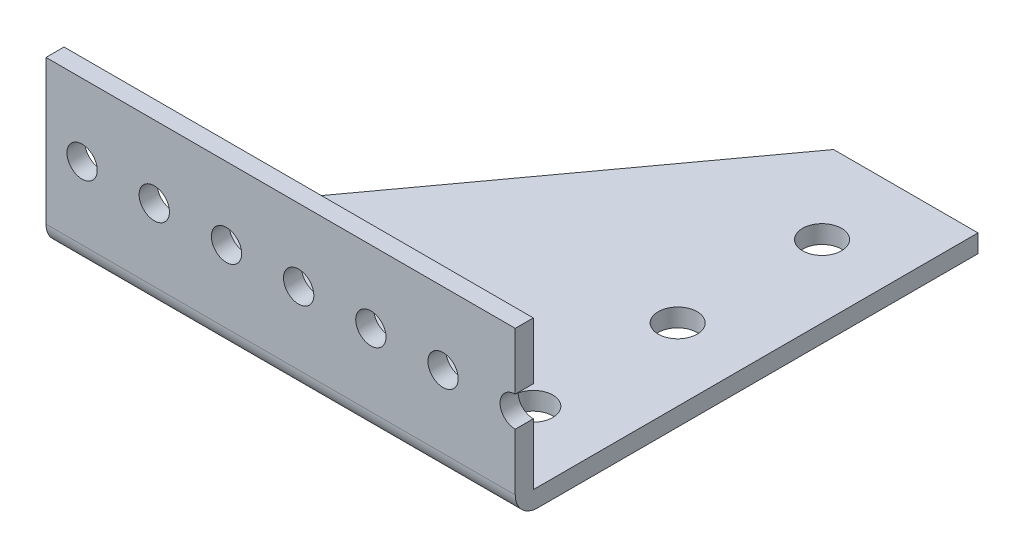
ISO-10303-21;
HEADER;
FILE_DESCRIPTION(('STEP AP214'),'2;1');
FILE_NAME('part.step','',(''),(''),'','','');
FILE_SCHEMA(('AUTOMOTIVE_DESIGN { 1 0 10303 214 1 1 1 1 }'));
ENDSEC;
DATA;
#1=APPLICATION_CONTEXT('core data for automotive mechanical design processes');
#2=APPLICATION_PROTOCOL_DEFINITION('international standard','automotive_design',2000,#1);
#3=PRODUCT_CONTEXT('',#1,'mechanical');
#4=PRODUCT('Part','Part','',(#3));
#5=PRODUCT_RELATED_PRODUCT_CATEGORY('part','',(#4));
#6=PRODUCT_DEFINITION_FORMATION('','',#4);
#7=PRODUCT_DEFINITION_CONTEXT('part definition',#1,'design');
#8=PRODUCT_DEFINITION('design','',#6,#7);
#9=PRODUCT_DEFINITION_SHAPE('','',#8);
#10=(LENGTH_UNIT() NAMED_UNIT(*) SI_UNIT(.MILLI.,.METRE.));
#11=(NAMED_UNIT(*) PLANE_ANGLE_UNIT() SI_UNIT($,.RADIAN.));
#12=(NAMED_UNIT(*) SI_UNIT($,.STERADIAN.) SOLID_ANGLE_UNIT());
#13=UNCERTAINTY_MEASURE_WITH_UNIT(LENGTH_MEASURE(1.E-05),#10,'distance_accuracy_value','');
#14=(GEOMETRIC_REPRESENTATION_CONTEXT(3) GLOBAL_UNCERTAINTY_ASSIGNED_CONTEXT((#13)) GLOBAL_UNIT_ASSIGNED_CONTEXT((#10,
#11,#12)) REPRESENTATION_CONTEXT('',''));
#15=CARTESIAN_POINT('',(0.,0.,0.));
#16=DIRECTION('',(0.,0.,1.));
#17=DIRECTION('',(1.,0.,0.));
#18=AXIS2_PLACEMENT_3D('',#15,#16,#17);
#19=CARTESIAN_POINT('',(41.275,-31.75,40.7035));
#20=DIRECTION('',(-1.,0.,0.));
#21=DIRECTION('',(0.,0.,1.));
#22=AXIS2_PLACEMENT_3D('',#19,#20,#21);
#23=PLANE('',#22);
#24=DIRECTION('',(0.,-1.,0.));
#25=VECTOR('',#24,1.);
#26=CARTESIAN_POINT('',(41.275,19.05,37.5284999999999));
#27=LINE('',#26,#25);
#28=CARTESIAN_POINT('',(41.275,-5.58799999999996,37.5284999999999));
#29=VERTEX_POINT('',#28);
#30=CARTESIAN_POINT('',(41.275,-15.621,37.5284999999999));
#31=VERTEX_POINT('',#30);
#32=EDGE_CURVE('E209',#29,#31,#27,.T.);
#33=ORIENTED_EDGE('',*,*,#32,.F.);
#34=DIRECTION('',(0.,0.,1.));
#35=VECTOR('',#34,1.);
#36=CARTESIAN_POINT('',(41.275,-5.58799999999996,-40.7035));
#37=LINE('',#36,#35);
#38=CARTESIAN_POINT('',(41.275,-5.58799999999996,40.7035));
#39=VERTEX_POINT('',#38);
#40=EDGE_CURVE('E59',#29,#39,#37,.T.);
#41=ORIENTED_EDGE('',*,*,#40,.T.);
#42=DIRECTION('',(0.,-1.,0.));
#43=VECTOR('',#42,1.);
#44=CARTESIAN_POINT('',(41.275,-31.75,40.7035));
#45=LINE('',#44,#43);
#46=CARTESIAN_POINT('',(41.275,-15.621,40.7035));
#47=VERTEX_POINT('',#46);
#48=EDGE_CURVE('E130',#39,#47,#45,.T.);
#49=ORIENTED_EDGE('',*,*,#48,.T.);
#50=DIRECTION('',(0.,0.,-1.));
#51=VECTOR('',#50,1.);
#52=CARTESIAN_POINT('',(41.275,-15.621,-40.7035));
#53=LINE('',#52,#51);
#54=EDGE_CURVE('E154',#47,#31,#53,.T.);
#55=ORIENTED_EDGE('',*,*,#54,.T.);
#56=EDGE_LOOP('',(#33,#41,#49,#55));
#57=FACE_BOUND('',#56,.T.);
#58=ADVANCED_FACE('F44',(#57),#23,.F.);
#59=CARTESIAN_POINT('',(-41.275,-31.75,40.7035));
#60=DIRECTION('',(0.,0.,-1.));
#61=DIRECTION('',(-1.,0.,0.));
#62=AXIS2_PLACEMENT_3D('',#59,#60,#61);
#63=PLANE('',#62);
#64=CARTESIAN_POINT('',(-22.225,-18.2879999999999,40.7035));
#65=DIRECTION('',(0.,0.,-1.));
#66=DIRECTION('',(-1.,0.,0.));
#67=AXIS2_PLACEMENT_3D('',#64,#65,#66);
#68=CIRCLE('',#67,2.66699999999997);
#69=CARTESIAN_POINT('',(-24.892,-18.2879999999999,40.7035));
#70=VERTEX_POINT('',#69);
#71=EDGE_CURVE('E172',#70,#70,#68,.T.);
#72=ORIENTED_EDGE('',*,*,#71,.T.);
#73=EDGE_LOOP('',(#72));
#74=FACE_BOUND('',#73,.T.);
#75=CARTESIAN_POINT('',(-9.52499999999998,-18.2879999999999,40.7035));
#76=DIRECTION('',(0.,0.,-1.));
#77=DIRECTION('',(-1.,0.,0.));
#78=AXIS2_PLACEMENT_3D('',#75,#76,#77);
#79=CIRCLE('',#78,2.66699999999998);
#80=CARTESIAN_POINT('',(-12.192,-18.2879999999999,40.7035));
#81=VERTEX_POINT('',#80);
#82=EDGE_CURVE('E171',#81,#81,#79,.T.);
#83=ORIENTED_EDGE('',*,*,#82,.T.);
#84=EDGE_LOOP('',(#83));
#85=FACE_BOUND('',#84,.T.);
#86=CARTESIAN_POINT('',(3.17500000000006,-18.2879999999999,40.7035));
#87=DIRECTION('',(0.,0.,-1.));
#88=DIRECTION('',(-1.,0.,0.));
#89=AXIS2_PLACEMENT_3D('',#86,#87,#88);
#90=CIRCLE('',#89,2.66699999999998);
#91=CARTESIAN_POINT('',(0.508000000000084,-18.2879999999999,40.7035));
#92=VERTEX_POINT('',#91);
#93=EDGE_CURVE('E167',#92,#92,#90,.T.);
#94=ORIENTED_EDGE('',*,*,#93,.T.);
#95=EDGE_LOOP('',(#94));
#96=FACE_BOUND('',#95,.T.);
#97=CARTESIAN_POINT('',(15.8750000000001,-18.2879999999999,40.7035));
#98=DIRECTION('',(0.,0.,-1.));
#99=DIRECTION('',(-1.,0.,0.));
#100=AXIS2_PLACEMENT_3D('',#97,#98,#99);
#101=CIRCLE('',#100,2.66699999999997);
#102=CARTESIAN_POINT('',(13.2080000000001,-18.2879999999999,40.7035));
#103=VERTEX_POINT('',#102);
#104=EDGE_CURVE('E166',#103,#103,#101,.T.);
#105=ORIENTED_EDGE('',*,*,#104,.T.);
#106=EDGE_LOOP('',(#105));
#107=FACE_BOUND('',#106,.T.);
#108=CARTESIAN_POINT('',(28.5750000000001,-18.2879999999999,40.7035));
#109=DIRECTION('',(0.,0.,-1.));
#110=DIRECTION('',(-1.,0.,0.));
#111=AXIS2_PLACEMENT_3D('',#108,#109,#110);
#112=CIRCLE('',#111,2.66699999999997);
#113=CARTESIAN_POINT('',(25.9080000000001,-18.2879999999999,40.7035));
#114=VERTEX_POINT('',#113);
#115=EDGE_CURVE('E162',#114,#114,#112,.T.);
#116=ORIENTED_EDGE('',*,*,#115,.T.);
#117=EDGE_LOOP('',(#116));
#118=FACE_BOUND('',#117,.T.);
#119=CARTESIAN_POINT('',(-34.925,-18.2879999999999,40.7035));
#120=DIRECTION('',(0.,0.,-1.));
#121=DIRECTION('',(-1.,0.,0.));
#122=AXIS2_PLACEMENT_3D('',#119,#120,#121);
#123=CIRCLE('',#122,2.66699999999997);
#124=CARTESIAN_POINT('',(-37.592,-18.2879999999999,40.7035));
#125=VERTEX_POINT('',#124);
#126=EDGE_CURVE('E161',#125,#125,#123,.T.);
#127=ORIENTED_EDGE('',*,*,#126,.T.);
#128=EDGE_LOOP('',(#127));
#129=FACE_BOUND('',#128,.T.);
#130=ORIENTED_EDGE('',*,*,#48,.F.);
#131=DIRECTION('',(1.,0.,0.));
#132=VECTOR('',#131,1.);
#133=CARTESIAN_POINT('',(41.275,-5.58799999999996,40.7035));
#134=LINE('',#133,#132);
#135=CARTESIAN_POINT('',(-41.275,-5.58799999999996,40.7035));
#136=VERTEX_POINT('',#135);
#137=EDGE_CURVE('E118',#136,#39,#134,.T.);
#138=ORIENTED_EDGE('',*,*,#137,.F.);
#139=DIRECTION('',(0.,-1.,0.));
#140=VECTOR('',#139,1.);
#141=CARTESIAN_POINT('',(-41.275,-31.75,40.7035));
#142=LINE('',#141,#140);
#143=CARTESIAN_POINT('',(-41.275,-30.988,40.7035));
#144=VERTEX_POINT('',#143);
#145=EDGE_CURVE('E127',#136,#144,#142,.T.);
#146=ORIENTED_EDGE('',*,*,#145,.T.);
#147=DIRECTION('',(1.,0.,0.));
#148=VECTOR('',#147,1.);
#149=CARTESIAN_POINT('',(-41.275,-30.988,40.7035));
#150=LINE('',#149,#148);
#151=CARTESIAN_POINT('',(41.275,-30.988,40.7035));
#152=VERTEX_POINT('',#151);
#153=EDGE_CURVE('E157',#144,#152,#150,.T.);
#154=ORIENTED_EDGE('',*,*,#153,.T.);
#155=CARTESIAN_POINT('',(41.275,-20.9549999999999,40.7035));
#156=VERTEX_POINT('',#155);
#157=EDGE_CURVE('E141',#156,#152,#45,.T.);
#158=ORIENTED_EDGE('',*,*,#157,.F.);
#159=CARTESIAN_POINT('',(41.275,-18.2879999999999,40.7035));
#160=DIRECTION('',(0.,0.,-1.));
#161=DIRECTION('',(-1.,0.,0.));
#162=AXIS2_PLACEMENT_3D('',#159,#160,#161);
#163=CIRCLE('',#162,2.66699999999997);
#164=EDGE_CURVE('E203',#156,#47,#163,.T.);
#165=ORIENTED_EDGE('',*,*,#164,.T.);
#166=EDGE_LOOP('',(#130,#138,#146,#154,#158,#165));
#167=FACE_BOUND('',#166,.T.);
#168=ADVANCED_FACE('F125',(#74,#85,#96,#107,#118,#129,#167),#63,.F.);
#169=ORIENTED_EDGE('',*,*,#157,.T.);
#170=CARTESIAN_POINT('',(41.275,-30.988,36.7665));
#171=DIRECTION('',(-1.,0.,0.));
#172=DIRECTION('',(0.,0.,1.));
#173=AXIS2_PLACEMENT_3D('',#170,#171,#172);
#174=CIRCLE('',#173,3.937);
#175=CARTESIAN_POINT('',(41.275,-34.925,36.7665));
#176=VERTEX_POINT('',#175);
#177=EDGE_CURVE('E174',#152,#176,#174,.F.);
#178=ORIENTED_EDGE('',*,*,#177,.T.);
#179=DIRECTION('',(0.,0.,-1.));
#180=VECTOR('',#179,1.);
#181=CARTESIAN_POINT('',(41.275,-34.925,40.7035));
#182=LINE('',#181,#180);
#183=CARTESIAN_POINT('',(41.275,-34.925,-40.7035));
#184=VERTEX_POINT('',#183);
#185=EDGE_CURVE('E219',#176,#184,#182,.T.);
#186=ORIENTED_EDGE('',*,*,#185,.T.);
#187=DIRECTION('',(0.,-1.,0.));
#188=VECTOR('',#187,1.);
#189=CARTESIAN_POINT('',(41.275,-31.75,-40.7035));
#190=LINE('',#189,#188);
#191=CARTESIAN_POINT('',(41.275,-31.75,-40.7035));
#192=VERTEX_POINT('',#191);
#193=EDGE_CURVE('E137',#192,#184,#190,.T.);
#194=ORIENTED_EDGE('',*,*,#193,.F.);
#195=DIRECTION('',(0.,0.,-1.));
#196=VECTOR('',#195,1.);
#197=CARTESIAN_POINT('',(41.275,-31.75,40.7035));
#198=LINE('',#197,#196);
#199=CARTESIAN_POINT('',(41.275,-31.75,37.5284999999999));
#200=VERTEX_POINT('',#199);
#201=EDGE_CURVE('E144',#200,#192,#198,.T.);
#202=ORIENTED_EDGE('',*,*,#201,.F.);
#203=CARTESIAN_POINT('',(41.275,-20.9549999999999,37.5284999999999));
#204=VERTEX_POINT('',#203);
#205=EDGE_CURVE('E196',#204,#200,#27,.T.);
#206=ORIENTED_EDGE('',*,*,#205,.F.);
#207=DIRECTION('',(0.,0.,-1.));
#208=VECTOR('',#207,1.);
#209=CARTESIAN_POINT('',(41.275,-20.9549999999999,-40.7035));
#210=LINE('',#209,#208);
#211=EDGE_CURVE('E151',#204,#156,#210,.F.);
#212=ORIENTED_EDGE('',*,*,#211,.T.);
#213=EDGE_LOOP('',(#169,#178,#186,#194,#202,#206,#212));
#214=FACE_BOUND('',#213,.T.);
#215=ADVANCED_FACE('F192',(#214),#23,.F.);
#216=CARTESIAN_POINT('',(41.275,-31.75,-40.7035));
#217=DIRECTION('',(0.,0.,1.));
#218=DIRECTION('',(1.,0.,0.));
#219=AXIS2_PLACEMENT_3D('',#216,#217,#218);
#220=PLANE('',#219);
#221=DIRECTION('',(-1.,0.,0.));
#222=VECTOR('',#221,1.);
#223=CARTESIAN_POINT('',(41.275,-34.925,-40.7035));
#224=LINE('',#223,#222);
#225=CARTESIAN_POINT('',(15.875,-34.925,-40.7035));
#226=VERTEX_POINT('',#225);
#227=EDGE_CURVE('E147',#184,#226,#224,.T.);
#228=ORIENTED_EDGE('',*,*,#227,.T.);
#229=DIRECTION('',(0.,-1.,0.));
#230=VECTOR('',#229,1.);
#231=CARTESIAN_POINT('',(15.875,19.05,-40.7035));
#232=LINE('',#231,#230);
#233=CARTESIAN_POINT('',(15.875,-31.75,-40.7035));
#234=VERTEX_POINT('',#233);
#235=EDGE_CURVE('E187',#234,#226,#232,.T.);
#236=ORIENTED_EDGE('',*,*,#235,.F.);
#237=DIRECTION('',(-1.,0.,0.));
#238=VECTOR('',#237,1.);
#239=CARTESIAN_POINT('',(41.275,-31.75,-40.7035));
#240=LINE('',#239,#238);
#241=EDGE_CURVE('E138',#192,#234,#240,.T.);
#242=ORIENTED_EDGE('',*,*,#241,.F.);
#243=ORIENTED_EDGE('',*,*,#193,.T.);
#244=EDGE_LOOP('',(#228,#236,#242,#243));
#245=FACE_BOUND('',#244,.T.);
#246=ADVANCED_FACE('F225',(#245),#220,.F.);
#247=CARTESIAN_POINT('',(-41.275,-31.75,40.7035));
#248=DIRECTION('',(1.,0.,0.));
#249=DIRECTION('',(0.,0.,-1.));
#250=AXIS2_PLACEMENT_3D('',#247,#248,#249);
#251=PLANE('',#250);
#252=ORIENTED_EDGE('',*,*,#145,.F.);
#253=DIRECTION('',(0.,0.,1.));
#254=VECTOR('',#253,1.);
#255=CARTESIAN_POINT('',(-41.275,-5.58799999999996,-40.7035));
#256=LINE('',#255,#254);
#257=CARTESIAN_POINT('',(-41.275,-5.58799999999996,37.5284999999999));
#258=VERTEX_POINT('',#257);
#259=EDGE_CURVE('E115',#258,#136,#256,.T.);
#260=ORIENTED_EDGE('',*,*,#259,.F.);
#261=DIRECTION('',(0.,-1.,0.));
#262=VECTOR('',#261,1.);
#263=CARTESIAN_POINT('',(-41.275,19.05,37.5284999999999));
#264=LINE('',#263,#262);
#265=CARTESIAN_POINT('',(-41.275,-31.75,37.5284999999999));
#266=VERTEX_POINT('',#265);
#267=EDGE_CURVE('E185',#258,#266,#264,.T.);
#268=ORIENTED_EDGE('',*,*,#267,.T.);
#269=DIRECTION('',(0.,-1.,0.));
#270=VECTOR('',#269,1.);
#271=CARTESIAN_POINT('',(-41.275,19.05,37.5284999999999));
#272=LINE('',#271,#270);
#273=CARTESIAN_POINT('',(-41.275,-34.8505542067394,37.5284999999999));
#274=VERTEX_POINT('',#273);
#275=EDGE_CURVE('E181',#266,#274,#272,.T.);
#276=ORIENTED_EDGE('',*,*,#275,.T.);
#277=CARTESIAN_POINT('',(-41.275,-30.988,36.7665));
#278=DIRECTION('',(1.,0.,0.));
#279=DIRECTION('',(0.,0.,-1.));
#280=AXIS2_PLACEMENT_3D('',#277,#278,#279);
#281=CIRCLE('',#280,3.937);
#282=EDGE_CURVE('E135',#274,#144,#281,.F.);
#283=ORIENTED_EDGE('',*,*,#282,.T.);
#284=EDGE_LOOP('',(#252,#260,#268,#276,#283));
#285=FACE_BOUND('',#284,.T.);
#286=ADVANCED_FACE('F132',(#285),#251,.F.);
#287=CARTESIAN_POINT('',(0.,-31.75,0.));
#288=DIRECTION('',(0.,1.,0.));
#289=DIRECTION('',(0.,0.,1.));
#290=AXIS2_PLACEMENT_3D('',#287,#288,#289);
#291=PLANE('',#290);
#292=DIRECTION('',(0.589885116714,0.,-0.807487181990718));
#293=VECTOR('',#292,1.);
#294=CARTESIAN_POINT('',(-9.03701688787468,-31.75,-6.601716882376));
#295=LINE('',#294,#293);
#296=EDGE_CURVE('E186',#266,#234,#295,.T.);
#297=ORIENTED_EDGE('',*,*,#296,.F.);
#298=DIRECTION('',(-1.,0.,0.));
#299=VECTOR('',#298,1.);
#300=CARTESIAN_POINT('',(-41.275,-31.75,37.5284999999999));
#301=LINE('',#300,#299);
#302=EDGE_CURVE('E210',#200,#266,#301,.T.);
#303=ORIENTED_EDGE('',*,*,#302,.F.);
#304=ORIENTED_EDGE('',*,*,#201,.T.);
#305=ORIENTED_EDGE('',*,*,#241,.T.);
#306=EDGE_LOOP('',(#297,#303,#304,#305));
#307=FACE_BOUND('',#306,.T.);
#308=CARTESIAN_POINT('',(28.575,-31.75,24.8284999999999));
#309=DIRECTION('',(0.,1.,0.));
#310=DIRECTION('',(0.,0.,1.));
#311=AXIS2_PLACEMENT_3D('',#308,#309,#310);
#312=CIRCLE('',#311,3.429);
#313=CARTESIAN_POINT('',(28.575,-31.75,28.2574999999999));
#314=VERTEX_POINT('',#313);
#315=EDGE_CURVE('E249',#314,#314,#312,.T.);
#316=ORIENTED_EDGE('',*,*,#315,.F.);
#317=EDGE_LOOP('',(#316));
#318=FACE_BOUND('',#317,.T.);
#319=CARTESIAN_POINT('',(28.5750000000003,-31.75,-0.571500000000103));
#320=DIRECTION('',(0.,1.,0.));
#321=DIRECTION('',(0.,0.,1.));
#322=AXIS2_PLACEMENT_3D('',#319,#320,#321);
#323=CIRCLE('',#322,3.429);
#324=CARTESIAN_POINT('',(28.5750000000003,-31.75,2.8574999999999));
#325=VERTEX_POINT('',#324);
#326=EDGE_CURVE('E246',#325,#325,#323,.T.);
#327=ORIENTED_EDGE('',*,*,#326,.F.);
#328=EDGE_LOOP('',(#327));
#329=FACE_BOUND('',#328,.T.);
#330=CARTESIAN_POINT('',(28.5750000000005,-31.75,-25.9715000000001));
#331=DIRECTION('',(0.,1.,0.));
#332=DIRECTION('',(0.,0.,1.));
#333=AXIS2_PLACEMENT_3D('',#330,#331,#332);
#334=CIRCLE('',#333,3.429);
#335=CARTESIAN_POINT('',(28.5750000000005,-31.75,-22.5425000000001));
#336=VERTEX_POINT('',#335);
#337=EDGE_CURVE('E243',#336,#336,#334,.T.);
#338=ORIENTED_EDGE('',*,*,#337,.F.);
#339=EDGE_LOOP('',(#338));
#340=FACE_BOUND('',#339,.T.);
#341=ADVANCED_FACE('F302',(#307,#318,#329,#340),#291,.T.);
#342=CARTESIAN_POINT('',(0.,-34.925,0.));
#343=DIRECTION('',(0.,1.,0.));
#344=DIRECTION('',(0.,0.,1.));
#345=AXIS2_PLACEMENT_3D('',#342,#343,#344);
#346=PLANE('',#345);
#347=CARTESIAN_POINT('',(28.575,-34.925,24.8284999999999));
#348=DIRECTION('',(0.,-1.,0.));
#349=DIRECTION('',(0.,0.,-1.));
#350=AXIS2_PLACEMENT_3D('',#347,#348,#349);
#351=CIRCLE('',#350,3.429);
#352=CARTESIAN_POINT('',(28.575,-34.925,21.3994999999999));
#353=VERTEX_POINT('',#352);
#354=EDGE_CURVE('E229',#353,#353,#351,.T.);
#355=ORIENTED_EDGE('',*,*,#354,.F.);
#356=EDGE_LOOP('',(#355));
#357=FACE_BOUND('',#356,.T.);
#358=CARTESIAN_POINT('',(28.5750000000003,-34.925,-0.571500000000103));
#359=DIRECTION('',(0.,-1.,0.));
#360=DIRECTION('',(0.,0.,-1.));
#361=AXIS2_PLACEMENT_3D('',#358,#359,#360);
#362=CIRCLE('',#361,3.429);
#363=CARTESIAN_POINT('',(28.5750000000003,-34.925,-4.0005000000001));
#364=VERTEX_POINT('',#363);
#365=EDGE_CURVE('E233',#364,#364,#362,.T.);
#366=ORIENTED_EDGE('',*,*,#365,.F.);
#367=EDGE_LOOP('',(#366));
#368=FACE_BOUND('',#367,.T.);
#369=CARTESIAN_POINT('',(28.5750000000005,-34.925,-25.9715000000001));
#370=DIRECTION('',(0.,-1.,0.));
#371=DIRECTION('',(0.,0.,-1.));
#372=AXIS2_PLACEMENT_3D('',#369,#370,#371);
#373=CIRCLE('',#372,3.429);
#374=CARTESIAN_POINT('',(28.5750000000005,-34.925,-29.4005000000001));
#375=VERTEX_POINT('',#374);
#376=EDGE_CURVE('E239',#375,#375,#373,.T.);
#377=ORIENTED_EDGE('',*,*,#376,.F.);
#378=EDGE_LOOP('',(#377));
#379=FACE_BOUND('',#378,.T.);
#380=DIRECTION('',(1.,0.,0.));
#381=VECTOR('',#380,1.);
#382=CARTESIAN_POINT('',(0.,-34.925,36.7665));
#383=LINE('',#382,#381);
#384=CARTESIAN_POINT('',(-40.7183441558442,-34.925,36.7665));
#385=VERTEX_POINT('',#384);
#386=EDGE_CURVE('E176',#176,#385,#383,.F.);
#387=ORIENTED_EDGE('',*,*,#386,.T.);
#388=DIRECTION('',(-0.589885116714,0.,0.807487181990718));
#389=VECTOR('',#388,1.);
#390=CARTESIAN_POINT('',(-41.275,-34.925,37.5284999999999));
#391=LINE('',#390,#389);
#392=EDGE_CURVE('E66',#226,#385,#391,.T.);
#393=ORIENTED_EDGE('',*,*,#392,.F.);
#394=ORIENTED_EDGE('',*,*,#227,.F.);
#395=ORIENTED_EDGE('',*,*,#185,.F.);
#396=EDGE_LOOP('',(#387,#393,#394,#395));
#397=FACE_BOUND('',#396,.T.);
#398=ADVANCED_FACE('F228',(#357,#368,#379,#397),#346,.F.);
#399=CARTESIAN_POINT('',(-41.275,19.05,37.5284999999999));
#400=DIRECTION('',(0.,0.,1.));
#401=DIRECTION('',(1.,0.,0.));
#402=AXIS2_PLACEMENT_3D('',#399,#400,#401);
#403=PLANE('',#402);
#404=CARTESIAN_POINT('',(-22.225,-18.2879999999999,37.5284999999999));
#405=DIRECTION('',(0.,0.,1.));
#406=DIRECTION('',(1.,0.,0.));
#407=AXIS2_PLACEMENT_3D('',#404,#405,#406);
#408=CIRCLE('',#407,2.66699999999998);
#409=CARTESIAN_POINT('',(-19.558,-18.2879999999999,37.5284999999999));
#410=VERTEX_POINT('',#409);
#411=EDGE_CURVE('E168',#410,#410,#408,.T.);
#412=ORIENTED_EDGE('',*,*,#411,.T.);
#413=EDGE_LOOP('',(#412));
#414=FACE_BOUND('',#413,.T.);
#415=CARTESIAN_POINT('',(-9.52499999999998,-18.2879999999999,37.5284999999999));
#416=DIRECTION('',(0.,0.,1.));
#417=DIRECTION('',(1.,0.,0.));
#418=AXIS2_PLACEMENT_3D('',#415,#416,#417);
#419=CIRCLE('',#418,2.66699999999998);
#420=CARTESIAN_POINT('',(-6.858,-18.2879999999999,37.5284999999999));
#421=VERTEX_POINT('',#420);
#422=EDGE_CURVE('E256',#421,#421,#419,.T.);
#423=ORIENTED_EDGE('',*,*,#422,.T.);
#424=EDGE_LOOP('',(#423));
#425=FACE_BOUND('',#424,.T.);
#426=CARTESIAN_POINT('',(3.17500000000006,-18.2879999999999,37.5284999999999));
#427=DIRECTION('',(0.,0.,1.));
#428=DIRECTION('',(1.,0.,0.));
#429=AXIS2_PLACEMENT_3D('',#426,#427,#428);
#430=CIRCLE('',#429,2.66699999999998);
#431=CARTESIAN_POINT('',(5.84200000000004,-18.2879999999999,37.5284999999999));
#432=VERTEX_POINT('',#431);
#433=EDGE_CURVE('E163',#432,#432,#430,.T.);
#434=ORIENTED_EDGE('',*,*,#433,.T.);
#435=EDGE_LOOP('',(#434));
#436=FACE_BOUND('',#435,.T.);
#437=CARTESIAN_POINT('',(15.8750000000001,-18.2879999999999,37.5284999999999));
#438=DIRECTION('',(0.,0.,1.));
#439=DIRECTION('',(1.,0.,0.));
#440=AXIS2_PLACEMENT_3D('',#437,#438,#439);
#441=CIRCLE('',#440,2.66699999999998);
#442=CARTESIAN_POINT('',(18.5420000000001,-18.2879999999999,37.5284999999999));
#443=VERTEX_POINT('',#442);
#444=EDGE_CURVE('E263',#443,#443,#441,.T.);
#445=ORIENTED_EDGE('',*,*,#444,.T.);
#446=EDGE_LOOP('',(#445));
#447=FACE_BOUND('',#446,.T.);
#448=CARTESIAN_POINT('',(28.5750000000001,-18.2879999999999,37.5284999999999));
#449=DIRECTION('',(0.,0.,1.));
#450=DIRECTION('',(1.,0.,0.));
#451=AXIS2_PLACEMENT_3D('',#448,#449,#450);
#452=CIRCLE('',#451,2.66699999999998);
#453=CARTESIAN_POINT('',(31.2420000000001,-18.2879999999999,37.5284999999999));
#454=VERTEX_POINT('',#453);
#455=EDGE_CURVE('E158',#454,#454,#452,.T.);
#456=ORIENTED_EDGE('',*,*,#455,.T.);
#457=EDGE_LOOP('',(#456));
#458=FACE_BOUND('',#457,.T.);
#459=CARTESIAN_POINT('',(-34.925,-18.2879999999999,37.5284999999999));
#460=DIRECTION('',(0.,0.,1.));
#461=DIRECTION('',(1.,0.,0.));
#462=AXIS2_PLACEMENT_3D('',#459,#460,#461);
#463=CIRCLE('',#462,2.66699999999998);
#464=CARTESIAN_POINT('',(-32.258,-18.2879999999999,37.5284999999999));
#465=VERTEX_POINT('',#464);
#466=EDGE_CURVE('E213',#465,#465,#463,.T.);
#467=ORIENTED_EDGE('',*,*,#466,.T.);
#468=EDGE_LOOP('',(#467));
#469=FACE_BOUND('',#468,.T.);
#470=ORIENTED_EDGE('',*,*,#267,.F.);
#471=DIRECTION('',(1.,0.,0.));
#472=VECTOR('',#471,1.);
#473=CARTESIAN_POINT('',(-41.275,-5.58799999999996,37.5284999999999));
#474=LINE('',#473,#472);
#475=EDGE_CURVE('E11',#258,#29,#474,.T.);
#476=ORIENTED_EDGE('',*,*,#475,.T.);
#477=ORIENTED_EDGE('',*,*,#32,.T.);
#478=CARTESIAN_POINT('',(41.275,-18.2879999999999,37.5284999999999));
#479=DIRECTION('',(0.,0.,1.));
#480=DIRECTION('',(1.,0.,0.));
#481=AXIS2_PLACEMENT_3D('',#478,#479,#480);
#482=CIRCLE('',#481,2.66699999999998);
#483=EDGE_CURVE('E202',#31,#204,#482,.T.);
#484=ORIENTED_EDGE('',*,*,#483,.T.);
#485=ORIENTED_EDGE('',*,*,#205,.T.);
#486=ORIENTED_EDGE('',*,*,#302,.T.);
#487=EDGE_LOOP('',(#470,#476,#477,#484,#485,#486));
#488=FACE_BOUND('',#487,.T.);
#489=ADVANCED_FACE('F205',(#414,#425,#436,#447,#458,#469,#488),#403,.F.);
#490=CARTESIAN_POINT('',(41.275,-18.2879999999999,-40.7035));
#491=DIRECTION('',(0.,0.,-1.));
#492=DIRECTION('',(-1.,0.,0.));
#493=AXIS2_PLACEMENT_3D('',#490,#491,#492);
#494=CYLINDRICAL_SURFACE('',#493,2.66699999999998);
#495=ORIENTED_EDGE('',*,*,#164,.F.);
#496=ORIENTED_EDGE('',*,*,#211,.F.);
#497=ORIENTED_EDGE('',*,*,#483,.F.);
#498=ORIENTED_EDGE('',*,*,#54,.F.);
#499=EDGE_LOOP('',(#495,#496,#497,#498));
#500=FACE_BOUND('',#499,.T.);
#501=ADVANCED_FACE('F200',(#500),#494,.F.);
#502=CARTESIAN_POINT('',(-34.925,-18.2879999999999,-40.7035));
#503=DIRECTION('',(0.,0.,-1.));
#504=DIRECTION('',(-1.,0.,0.));
#505=AXIS2_PLACEMENT_3D('',#502,#503,#504);
#506=CYLINDRICAL_SURFACE('',#505,2.66699999999998);
#507=ORIENTED_EDGE('',*,*,#126,.F.);
#508=EDGE_LOOP('',(#507));
#509=FACE_BOUND('',#508,.T.);
#510=ORIENTED_EDGE('',*,*,#466,.F.);
#511=EDGE_LOOP('',(#510));
#512=FACE_BOUND('',#511,.T.);
#513=ADVANCED_FACE('F273',(#509,#512),#506,.F.);
#514=CARTESIAN_POINT('',(28.5750000000001,-18.2879999999999,-40.7035));
#515=DIRECTION('',(0.,0.,-1.));
#516=DIRECTION('',(-1.,0.,0.));
#517=AXIS2_PLACEMENT_3D('',#514,#515,#516);
#518=CYLINDRICAL_SURFACE('',#517,2.66699999999998);
#519=ORIENTED_EDGE('',*,*,#115,.F.);
#520=EDGE_LOOP('',(#519));
#521=FACE_BOUND('',#520,.T.);
#522=ORIENTED_EDGE('',*,*,#455,.F.);
#523=EDGE_LOOP('',(#522));
#524=FACE_BOUND('',#523,.T.);
#525=ADVANCED_FACE('F275',(#521,#524),#518,.F.);
#526=CARTESIAN_POINT('',(15.8750000000001,-18.2879999999999,-40.7035));
#527=DIRECTION('',(0.,0.,-1.));
#528=DIRECTION('',(-1.,0.,0.));
#529=AXIS2_PLACEMENT_3D('',#526,#527,#528);
#530=CYLINDRICAL_SURFACE('',#529,2.66699999999998);
#531=ORIENTED_EDGE('',*,*,#104,.F.);
#532=EDGE_LOOP('',(#531));
#533=FACE_BOUND('',#532,.T.);
#534=ORIENTED_EDGE('',*,*,#444,.F.);
#535=EDGE_LOOP('',(#534));
#536=FACE_BOUND('',#535,.T.);
#537=ADVANCED_FACE('F282',(#533,#536),#530,.F.);
#538=CARTESIAN_POINT('',(3.17500000000006,-18.2879999999999,-40.7035));
#539=DIRECTION('',(0.,0.,-1.));
#540=DIRECTION('',(-1.,0.,0.));
#541=AXIS2_PLACEMENT_3D('',#538,#539,#540);
#542=CYLINDRICAL_SURFACE('',#541,2.66699999999998);
#543=ORIENTED_EDGE('',*,*,#93,.F.);
#544=EDGE_LOOP('',(#543));
#545=FACE_BOUND('',#544,.T.);
#546=ORIENTED_EDGE('',*,*,#433,.F.);
#547=EDGE_LOOP('',(#546));
#548=FACE_BOUND('',#547,.T.);
#549=ADVANCED_FACE('F327',(#545,#548),#542,.F.);
#550=CARTESIAN_POINT('',(-9.52499999999998,-18.2879999999999,-40.7035));
#551=DIRECTION('',(0.,0.,-1.));
#552=DIRECTION('',(-1.,0.,0.));
#553=AXIS2_PLACEMENT_3D('',#550,#551,#552);
#554=CYLINDRICAL_SURFACE('',#553,2.66699999999998);
#555=ORIENTED_EDGE('',*,*,#82,.F.);
#556=EDGE_LOOP('',(#555));
#557=FACE_BOUND('',#556,.T.);
#558=ORIENTED_EDGE('',*,*,#422,.F.);
#559=EDGE_LOOP('',(#558));
#560=FACE_BOUND('',#559,.T.);
#561=ADVANCED_FACE('F333',(#557,#560),#554,.F.);
#562=CARTESIAN_POINT('',(-22.225,-18.2879999999999,-40.7035));
#563=DIRECTION('',(0.,0.,-1.));
#564=DIRECTION('',(-1.,0.,0.));
#565=AXIS2_PLACEMENT_3D('',#562,#563,#564);
#566=CYLINDRICAL_SURFACE('',#565,2.66699999999998);
#567=ORIENTED_EDGE('',*,*,#71,.F.);
#568=EDGE_LOOP('',(#567));
#569=FACE_BOUND('',#568,.T.);
#570=ORIENTED_EDGE('',*,*,#411,.F.);
#571=EDGE_LOOP('',(#570));
#572=FACE_BOUND('',#571,.T.);
#573=ADVANCED_FACE('F340',(#569,#572),#566,.F.);
#574=CARTESIAN_POINT('',(-41.275,-30.988,36.7665));
#575=DIRECTION('',(1.,0.,0.));
#576=DIRECTION('',(0.,0.,-1.));
#577=AXIS2_PLACEMENT_3D('',#574,#575,#576);
#578=CYLINDRICAL_SURFACE('',#577,3.937);
#579=CARTESIAN_POINT('',(-40.7183441558442,-30.988,36.7665));
#580=DIRECTION('',(0.807487181990718,0.,0.589885116714));
#581=DIRECTION('',(0.589885116714,0.,-0.807487181990718));
#582=AXIS2_PLACEMENT_3D('',#579,#580,#581);
#583=ELLIPSE('',#582,4.87561918976103,3.937);
#584=EDGE_CURVE('E52',#385,#274,#583,.F.);
#585=ORIENTED_EDGE('',*,*,#584,.F.);
#586=ORIENTED_EDGE('',*,*,#386,.F.);
#587=ORIENTED_EDGE('',*,*,#177,.F.);
#588=ORIENTED_EDGE('',*,*,#153,.F.);
#589=ORIENTED_EDGE('',*,*,#282,.F.);
#590=EDGE_LOOP('',(#585,#586,#587,#588,#589));
#591=FACE_BOUND('',#590,.T.);
#592=ADVANCED_FACE('F46',(#591),#578,.T.);
#593=CARTESIAN_POINT('',(-41.275,19.05,37.5284999999999));
#594=DIRECTION('',(0.807487181990718,0.,0.589885116714));
#595=DIRECTION('',(0.589885116714,0.,-0.807487181990718));
#596=AXIS2_PLACEMENT_3D('',#593,#594,#595);
#597=PLANE('',#596);
#598=ORIENTED_EDGE('',*,*,#296,.T.);
#599=ORIENTED_EDGE('',*,*,#235,.T.);
#600=ORIENTED_EDGE('',*,*,#392,.T.);
#601=ORIENTED_EDGE('',*,*,#584,.T.);
#602=ORIENTED_EDGE('',*,*,#275,.F.);
#603=EDGE_LOOP('',(#598,#599,#600,#601,#602));
#604=FACE_BOUND('',#603,.T.);
#605=ADVANCED_FACE('F180',(#604),#597,.F.);
#606=CARTESIAN_POINT('',(28.5750000000005,19.05,-25.9715000000001));
#607=DIRECTION('',(0.,-1.,0.));
#608=DIRECTION('',(0.,0.,-1.));
#609=AXIS2_PLACEMENT_3D('',#606,#607,#608);
#610=CYLINDRICAL_SURFACE('',#609,3.429);
#611=ORIENTED_EDGE('',*,*,#337,.T.);
#612=EDGE_LOOP('',(#611));
#613=FACE_BOUND('',#612,.T.);
#614=ORIENTED_EDGE('',*,*,#376,.T.);
#615=EDGE_LOOP('',(#614));
#616=FACE_BOUND('',#615,.T.);
#617=ADVANCED_FACE('F345',(#613,#616),#610,.F.);
#618=CARTESIAN_POINT('',(28.5750000000003,19.05,-0.571500000000103));
#619=DIRECTION('',(0.,-1.,0.));
#620=DIRECTION('',(0.,0.,-1.));
#621=AXIS2_PLACEMENT_3D('',#618,#619,#620);
#622=CYLINDRICAL_SURFACE('',#621,3.429);
#623=ORIENTED_EDGE('',*,*,#326,.T.);
#624=EDGE_LOOP('',(#623));
#625=FACE_BOUND('',#624,.T.);
#626=ORIENTED_EDGE('',*,*,#365,.T.);
#627=EDGE_LOOP('',(#626));
#628=FACE_BOUND('',#627,.T.);
#629=ADVANCED_FACE('F348',(#625,#628),#622,.F.);
#630=CARTESIAN_POINT('',(28.575,19.05,24.8284999999999));
#631=DIRECTION('',(0.,-1.,0.));
#632=DIRECTION('',(0.,0.,-1.));
#633=AXIS2_PLACEMENT_3D('',#630,#631,#632);
#634=CYLINDRICAL_SURFACE('',#633,3.429);
#635=ORIENTED_EDGE('',*,*,#315,.T.);
#636=EDGE_LOOP('',(#635));
#637=FACE_BOUND('',#636,.T.);
#638=ORIENTED_EDGE('',*,*,#354,.T.);
#639=EDGE_LOOP('',(#638));
#640=FACE_BOUND('',#639,.T.);
#641=ADVANCED_FACE('F352',(#637,#640),#634,.F.);
#642=CARTESIAN_POINT('',(41.275,-5.58799999999996,-40.7035));
#643=DIRECTION('',(0.,-1.,0.));
#644=DIRECTION('',(0.,0.,-1.));
#645=AXIS2_PLACEMENT_3D('',#642,#643,#644);
#646=PLANE('',#645);
#647=ORIENTED_EDGE('',*,*,#259,.T.);
#648=ORIENTED_EDGE('',*,*,#137,.T.);
#649=ORIENTED_EDGE('',*,*,#40,.F.);
#650=ORIENTED_EDGE('',*,*,#475,.F.);
#651=EDGE_LOOP('',(#647,#648,#649,#650));
#652=FACE_BOUND('',#651,.T.);
#653=ADVANCED_FACE('F117',(#652),#646,.F.);
#654=CLOSED_SHELL('',(#58,#168,#215,#246,#286,#341,#398,#489,#501,#513,#525,#537,#549,#561,#573,
#592,#605,#617,#629,#641,#653));
#655=MANIFOLD_SOLID_BREP('B2',#654);
#656=ADVANCED_BREP_SHAPE_REPRESENTATION('',(#18,#655),#14);
#657=SHAPE_DEFINITION_REPRESENTATION(#9,#656);
ENDSEC;
END-ISO-10303-21;
